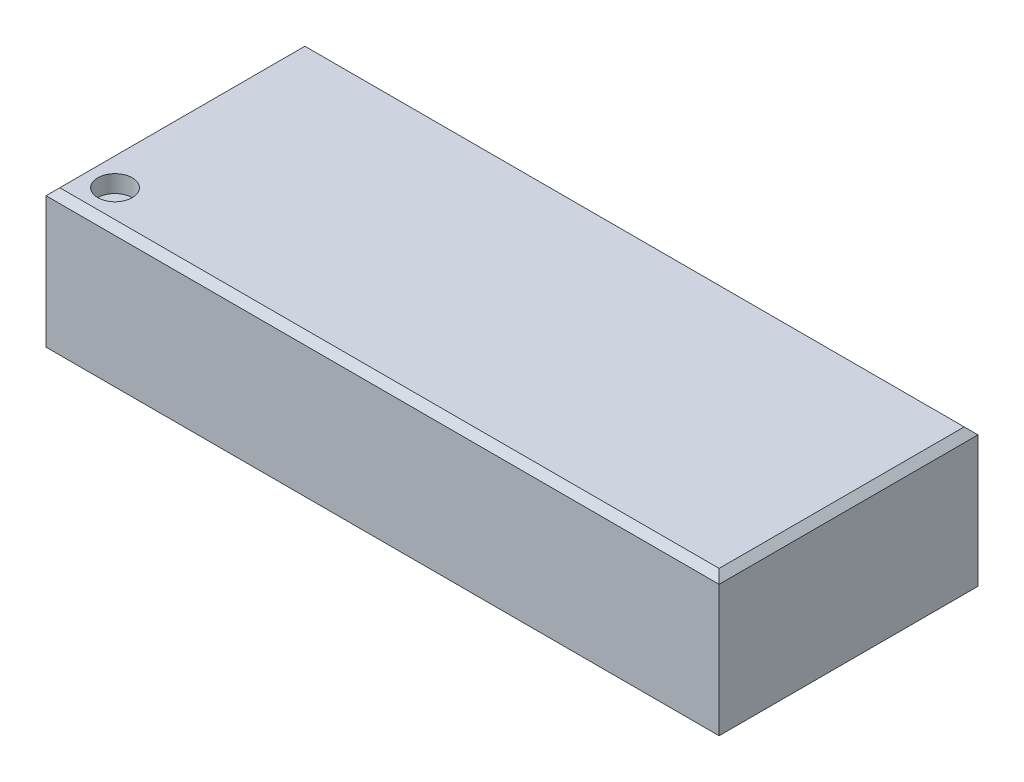
ISO-10303-21;
HEADER;
FILE_DESCRIPTION(('STEP AP214'),'2;1');
FILE_NAME('part.step','',(''),(''),'','','');
FILE_SCHEMA(('AUTOMOTIVE_DESIGN { 1 0 10303 214 1 1 1 1 }'));
ENDSEC;
DATA;
#1=APPLICATION_CONTEXT('core data for automotive mechanical design processes');
#2=APPLICATION_PROTOCOL_DEFINITION('international standard','automotive_design',2000,#1);
#3=PRODUCT_CONTEXT('',#1,'mechanical');
#4=PRODUCT('Part','Part','',(#3));
#5=PRODUCT_RELATED_PRODUCT_CATEGORY('part','',(#4));
#6=PRODUCT_DEFINITION_FORMATION('','',#4);
#7=PRODUCT_DEFINITION_CONTEXT('part definition',#1,'design');
#8=PRODUCT_DEFINITION('design','',#6,#7);
#9=PRODUCT_DEFINITION_SHAPE('','',#8);
#10=(LENGTH_UNIT() NAMED_UNIT(*) SI_UNIT(.MILLI.,.METRE.));
#11=(NAMED_UNIT(*) PLANE_ANGLE_UNIT() SI_UNIT($,.RADIAN.));
#12=(NAMED_UNIT(*) SI_UNIT($,.STERADIAN.) SOLID_ANGLE_UNIT());
#13=UNCERTAINTY_MEASURE_WITH_UNIT(LENGTH_MEASURE(1.E-05),#10,'distance_accuracy_value','');
#14=(GEOMETRIC_REPRESENTATION_CONTEXT(3) GLOBAL_UNCERTAINTY_ASSIGNED_CONTEXT((#13)) GLOBAL_UNIT_ASSIGNED_CONTEXT((#10,
#11,#12)) REPRESENTATION_CONTEXT('',''));
#15=CARTESIAN_POINT('',(0.,0.,0.));
#16=DIRECTION('',(0.,0.,1.));
#17=DIRECTION('',(1.,0.,0.));
#18=AXIS2_PLACEMENT_3D('',#15,#16,#17);
#19=CARTESIAN_POINT('',(-4.875,2.,-1.875));
#20=DIRECTION('',(1.,0.,0.));
#21=DIRECTION('',(0.,0.,-1.));
#22=AXIS2_PLACEMENT_3D('',#19,#20,#21);
#23=PLANE('',#22);
#24=DIRECTION('',(0.,-1.,0.));
#25=VECTOR('',#24,1.);
#26=CARTESIAN_POINT('',(-4.875,2.,1.875));
#27=LINE('',#26,#25);
#28=CARTESIAN_POINT('',(-4.875,1.9,1.875));
#29=VERTEX_POINT('',#28);
#30=CARTESIAN_POINT('',(-4.875,0.,1.875));
#31=VERTEX_POINT('',#30);
#32=EDGE_CURVE('E87',#29,#31,#27,.T.);
#33=ORIENTED_EDGE('',*,*,#32,.F.);
#34=DIRECTION('',(0.,0.,-1.));
#35=VECTOR('',#34,1.);
#36=CARTESIAN_POINT('',(-4.875,1.9,-1.875));
#37=LINE('',#36,#35);
#38=CARTESIAN_POINT('',(-4.875,1.9,-1.875));
#39=VERTEX_POINT('',#38);
#40=EDGE_CURVE('E11',#29,#39,#37,.T.);
#41=ORIENTED_EDGE('',*,*,#40,.T.);
#42=DIRECTION('',(0.,-1.,0.));
#43=VECTOR('',#42,1.);
#44=CARTESIAN_POINT('',(-4.875,2.,-1.875));
#45=LINE('',#44,#43);
#46=CARTESIAN_POINT('',(-4.875,0.,-1.875));
#47=VERTEX_POINT('',#46);
#48=EDGE_CURVE('E104',#39,#47,#45,.T.);
#49=ORIENTED_EDGE('',*,*,#48,.T.);
#50=DIRECTION('',(0.,0.,1.));
#51=VECTOR('',#50,1.);
#52=CARTESIAN_POINT('',(-4.875,0.,-1.875));
#53=LINE('',#52,#51);
#54=EDGE_CURVE('E100',#47,#31,#53,.T.);
#55=ORIENTED_EDGE('',*,*,#54,.T.);
#56=EDGE_LOOP('',(#33,#41,#49,#55));
#57=FACE_BOUND('',#56,.T.);
#58=ADVANCED_FACE('F35',(#57),#23,.F.);
#59=CARTESIAN_POINT('',(-4.875,2.,1.875));
#60=DIRECTION('',(0.,0.,-1.));
#61=DIRECTION('',(-1.,0.,0.));
#62=AXIS2_PLACEMENT_3D('',#59,#60,#61);
#63=PLANE('',#62);
#64=DIRECTION('',(0.,-1.,0.));
#65=VECTOR('',#64,1.);
#66=CARTESIAN_POINT('',(4.875,2.,1.875));
#67=LINE('',#66,#65);
#68=CARTESIAN_POINT('',(4.875,1.9,1.875));
#69=VERTEX_POINT('',#68);
#70=CARTESIAN_POINT('',(4.875,0.,1.875));
#71=VERTEX_POINT('',#70);
#72=EDGE_CURVE('E94',#69,#71,#67,.T.);
#73=ORIENTED_EDGE('',*,*,#72,.F.);
#74=DIRECTION('',(-1.,0.,0.));
#75=VECTOR('',#74,1.);
#76=CARTESIAN_POINT('',(-4.875,1.9,1.875));
#77=LINE('',#76,#75);
#78=EDGE_CURVE('E58',#69,#29,#77,.T.);
#79=ORIENTED_EDGE('',*,*,#78,.T.);
#80=ORIENTED_EDGE('',*,*,#32,.T.);
#81=DIRECTION('',(1.,0.,0.));
#82=VECTOR('',#81,1.);
#83=CARTESIAN_POINT('',(-4.875,0.,1.875));
#84=LINE('',#83,#82);
#85=EDGE_CURVE('E90',#31,#71,#84,.T.);
#86=ORIENTED_EDGE('',*,*,#85,.T.);
#87=EDGE_LOOP('',(#73,#79,#80,#86));
#88=FACE_BOUND('',#87,.T.);
#89=ADVANCED_FACE('F89',(#88),#63,.F.);
#90=CARTESIAN_POINT('',(4.875,2.,-1.875));
#91=DIRECTION('',(-1.,0.,0.));
#92=DIRECTION('',(0.,0.,1.));
#93=AXIS2_PLACEMENT_3D('',#90,#91,#92);
#94=PLANE('',#93);
#95=DIRECTION('',(0.,-1.,0.));
#96=VECTOR('',#95,1.);
#97=CARTESIAN_POINT('',(4.875,2.,-1.875));
#98=LINE('',#97,#96);
#99=CARTESIAN_POINT('',(4.875,1.9,-1.875));
#100=VERTEX_POINT('',#99);
#101=CARTESIAN_POINT('',(4.875,0.,-1.875));
#102=VERTEX_POINT('',#101);
#103=EDGE_CURVE('E117',#100,#102,#98,.T.);
#104=ORIENTED_EDGE('',*,*,#103,.F.);
#105=DIRECTION('',(0.,0.,1.));
#106=VECTOR('',#105,1.);
#107=CARTESIAN_POINT('',(4.875,1.9,1.875));
#108=LINE('',#107,#106);
#109=EDGE_CURVE('E128',#100,#69,#108,.T.);
#110=ORIENTED_EDGE('',*,*,#109,.T.);
#111=ORIENTED_EDGE('',*,*,#72,.T.);
#112=DIRECTION('',(0.,0.,-1.));
#113=VECTOR('',#112,1.);
#114=CARTESIAN_POINT('',(4.875,0.,-1.875));
#115=LINE('',#114,#113);
#116=EDGE_CURVE('E102',#71,#102,#115,.T.);
#117=ORIENTED_EDGE('',*,*,#116,.T.);
#118=EDGE_LOOP('',(#104,#110,#111,#117));
#119=FACE_BOUND('',#118,.T.);
#120=ADVANCED_FACE('F161',(#119),#94,.F.);
#121=CARTESIAN_POINT('',(-4.875,2.,-1.875));
#122=DIRECTION('',(0.,0.,1.));
#123=DIRECTION('',(1.,0.,0.));
#124=AXIS2_PLACEMENT_3D('',#121,#122,#123);
#125=PLANE('',#124);
#126=ORIENTED_EDGE('',*,*,#48,.F.);
#127=DIRECTION('',(1.,0.,0.));
#128=VECTOR('',#127,1.);
#129=CARTESIAN_POINT('',(4.875,1.9,-1.875));
#130=LINE('',#129,#128);
#131=EDGE_CURVE('E44',#39,#100,#130,.T.);
#132=ORIENTED_EDGE('',*,*,#131,.T.);
#133=ORIENTED_EDGE('',*,*,#103,.T.);
#134=DIRECTION('',(-1.,0.,0.));
#135=VECTOR('',#134,1.);
#136=CARTESIAN_POINT('',(-4.875,0.,-1.875));
#137=LINE('',#136,#135);
#138=EDGE_CURVE('E114',#102,#47,#137,.T.);
#139=ORIENTED_EDGE('',*,*,#138,.T.);
#140=EDGE_LOOP('',(#126,#132,#133,#139));
#141=FACE_BOUND('',#140,.T.);
#142=ADVANCED_FACE('F153',(#141),#125,.F.);
#143=CARTESIAN_POINT('',(0.,2.,0.));
#144=DIRECTION('',(0.,1.,0.));
#145=DIRECTION('',(0.,0.,1.));
#146=AXIS2_PLACEMENT_3D('',#143,#144,#145);
#147=PLANE('',#146);
#148=DIRECTION('',(1.,0.,0.));
#149=VECTOR('',#148,1.);
#150=CARTESIAN_POINT('',(4.875,2.,1.775));
#151=LINE('',#150,#149);
#152=CARTESIAN_POINT('',(-4.775,2.,1.775));
#153=VERTEX_POINT('',#152);
#154=CARTESIAN_POINT('',(4.775,2.,1.775));
#155=VERTEX_POINT('',#154);
#156=EDGE_CURVE('E123',#153,#155,#151,.T.);
#157=ORIENTED_EDGE('',*,*,#156,.T.);
#158=DIRECTION('',(0.,0.,-1.));
#159=VECTOR('',#158,1.);
#160=CARTESIAN_POINT('',(4.775,2.,-1.875));
#161=LINE('',#160,#159);
#162=CARTESIAN_POINT('',(4.775,2.,-1.775));
#163=VERTEX_POINT('',#162);
#164=EDGE_CURVE('E125',#155,#163,#161,.T.);
#165=ORIENTED_EDGE('',*,*,#164,.T.);
#166=DIRECTION('',(-1.,0.,0.));
#167=VECTOR('',#166,1.);
#168=CARTESIAN_POINT('',(-4.875,2.,-1.775));
#169=LINE('',#168,#167);
#170=CARTESIAN_POINT('',(-4.775,2.,-1.775));
#171=VERTEX_POINT('',#170);
#172=EDGE_CURVE('E121',#163,#171,#169,.T.);
#173=ORIENTED_EDGE('',*,*,#172,.T.);
#174=DIRECTION('',(0.,0.,1.));
#175=VECTOR('',#174,1.);
#176=CARTESIAN_POINT('',(-4.775,2.,1.875));
#177=LINE('',#176,#175);
#178=EDGE_CURVE('E93',#171,#153,#177,.T.);
#179=ORIENTED_EDGE('',*,*,#178,.T.);
#180=EDGE_LOOP('',(#157,#165,#173,#179));
#181=FACE_BOUND('',#180,.T.);
#182=CARTESIAN_POINT('',(-4.375,2.,1.375));
#183=DIRECTION('',(0.,1.,0.));
#184=DIRECTION('',(0.,0.,1.));
#185=AXIS2_PLACEMENT_3D('',#182,#183,#184);
#186=CIRCLE('',#185,0.25);
#187=CARTESIAN_POINT('',(-4.375,2.,1.625));
#188=VERTEX_POINT('',#187);
#189=EDGE_CURVE('E109',#188,#188,#186,.T.);
#190=ORIENTED_EDGE('',*,*,#189,.F.);
#191=EDGE_LOOP('',(#190));
#192=FACE_BOUND('',#191,.T.);
#193=ADVANCED_FACE('F151',(#181,#192),#147,.T.);
#194=CARTESIAN_POINT('',(0.,0.,0.));
#195=DIRECTION('',(0.,1.,0.));
#196=DIRECTION('',(0.,0.,1.));
#197=AXIS2_PLACEMENT_3D('',#194,#195,#196);
#198=PLANE('',#197);
#199=ORIENTED_EDGE('',*,*,#54,.F.);
#200=ORIENTED_EDGE('',*,*,#138,.F.);
#201=ORIENTED_EDGE('',*,*,#116,.F.);
#202=ORIENTED_EDGE('',*,*,#85,.F.);
#203=EDGE_LOOP('',(#199,#200,#201,#202));
#204=FACE_BOUND('',#203,.T.);
#205=ADVANCED_FACE('F98',(#204),#198,.F.);
#206=CARTESIAN_POINT('',(-4.375,1.75,1.375));
#207=DIRECTION('',(0.,1.,0.));
#208=DIRECTION('',(0.,0.,1.));
#209=AXIS2_PLACEMENT_3D('',#206,#207,#208);
#210=CYLINDRICAL_SURFACE('',#209,0.25);
#211=CARTESIAN_POINT('',(-4.375,1.75,1.375));
#212=DIRECTION('',(0.,1.,0.));
#213=DIRECTION('',(0.,0.,1.));
#214=AXIS2_PLACEMENT_3D('',#211,#212,#213);
#215=CIRCLE('',#214,0.25);
#216=CARTESIAN_POINT('',(-4.375,1.75,1.625));
#217=VERTEX_POINT('',#216);
#218=EDGE_CURVE('E106',#217,#217,#215,.T.);
#219=ORIENTED_EDGE('',*,*,#218,.F.);
#220=EDGE_LOOP('',(#219));
#221=FACE_BOUND('',#220,.T.);
#222=ORIENTED_EDGE('',*,*,#189,.T.);
#223=EDGE_LOOP('',(#222));
#224=FACE_BOUND('',#223,.T.);
#225=ADVANCED_FACE('F149',(#221,#224),#210,.F.);
#226=CARTESIAN_POINT('',(-4.375,1.75,1.375));
#227=DIRECTION('',(0.,1.,0.));
#228=DIRECTION('',(0.,0.,1.));
#229=AXIS2_PLACEMENT_3D('',#226,#227,#228);
#230=PLANE('',#229);
#231=ORIENTED_EDGE('',*,*,#218,.T.);
#232=EDGE_LOOP('',(#231));
#233=FACE_BOUND('',#232,.T.);
#234=ADVANCED_FACE('F184',(#233),#230,.T.);
#235=CARTESIAN_POINT('',(-4.775,2.,0.));
#236=DIRECTION('',(-0.707106781186547,0.707106781186547,0.));
#237=DIRECTION('',(0.,0.,-1.));
#238=AXIS2_PLACEMENT_3D('',#235,#236,#237);
#239=PLANE('',#238);
#240=DIRECTION('',(-0.577350269189626,-0.577350269189626,-0.577350269189626));
#241=VECTOR('',#240,1.);
#242=CARTESIAN_POINT('',(-4.18333333333333,2.59166666666667,-1.18333333333333));
#243=LINE('',#242,#241);
#244=EDGE_CURVE('E136',#39,#171,#243,.F.);
#245=ORIENTED_EDGE('',*,*,#244,.F.);
#246=ORIENTED_EDGE('',*,*,#40,.F.);
#247=DIRECTION('',(0.577350269189626,0.577350269189626,-0.577350269189626));
#248=VECTOR('',#247,1.);
#249=CARTESIAN_POINT('',(-4.18333333333333,2.59166666666667,1.18333333333333));
#250=LINE('',#249,#248);
#251=EDGE_CURVE('E39',#153,#29,#250,.F.);
#252=ORIENTED_EDGE('',*,*,#251,.F.);
#253=ORIENTED_EDGE('',*,*,#178,.F.);
#254=EDGE_LOOP('',(#245,#246,#252,#253));
#255=FACE_BOUND('',#254,.T.);
#256=ADVANCED_FACE('F37',(#255),#239,.T.);
#257=CARTESIAN_POINT('',(0.,2.,1.775));
#258=DIRECTION('',(0.,0.707106781186547,0.707106781186547));
#259=DIRECTION('',(-1.,0.,0.));
#260=AXIS2_PLACEMENT_3D('',#257,#258,#259);
#261=PLANE('',#260);
#262=ORIENTED_EDGE('',*,*,#251,.T.);
#263=ORIENTED_EDGE('',*,*,#78,.F.);
#264=DIRECTION('',(-0.577350269189626,0.577350269189626,-0.577350269189626));
#265=VECTOR('',#264,1.);
#266=CARTESIAN_POINT('',(3.18333333333333,3.59166666666667,0.183333333333332));
#267=LINE('',#266,#265);
#268=EDGE_CURVE('E135',#155,#69,#267,.F.);
#269=ORIENTED_EDGE('',*,*,#268,.F.);
#270=ORIENTED_EDGE('',*,*,#156,.F.);
#271=EDGE_LOOP('',(#262,#263,#269,#270));
#272=FACE_BOUND('',#271,.T.);
#273=ADVANCED_FACE('F179',(#272),#261,.T.);
#274=CARTESIAN_POINT('',(0.,2.,-1.775));
#275=DIRECTION('',(0.,0.707106781186547,-0.707106781186547));
#276=DIRECTION('',(1.,0.,0.));
#277=AXIS2_PLACEMENT_3D('',#274,#275,#276);
#278=PLANE('',#277);
#279=ORIENTED_EDGE('',*,*,#244,.T.);
#280=ORIENTED_EDGE('',*,*,#172,.F.);
#281=DIRECTION('',(0.577350269189626,-0.577350269189626,-0.577350269189626));
#282=VECTOR('',#281,1.);
#283=CARTESIAN_POINT('',(3.18333333333333,3.59166666666667,-0.183333333333335));
#284=LINE('',#283,#282);
#285=EDGE_CURVE('E133',#100,#163,#284,.F.);
#286=ORIENTED_EDGE('',*,*,#285,.F.);
#287=ORIENTED_EDGE('',*,*,#131,.F.);
#288=EDGE_LOOP('',(#279,#280,#286,#287));
#289=FACE_BOUND('',#288,.T.);
#290=ADVANCED_FACE('F176',(#289),#278,.T.);
#291=CARTESIAN_POINT('',(4.775,2.,0.));
#292=DIRECTION('',(0.707106781186547,0.707106781186547,0.));
#293=DIRECTION('',(0.,0.,1.));
#294=AXIS2_PLACEMENT_3D('',#291,#292,#293);
#295=PLANE('',#294);
#296=ORIENTED_EDGE('',*,*,#268,.T.);
#297=ORIENTED_EDGE('',*,*,#109,.F.);
#298=ORIENTED_EDGE('',*,*,#285,.T.);
#299=ORIENTED_EDGE('',*,*,#164,.F.);
#300=EDGE_LOOP('',(#296,#297,#298,#299));
#301=FACE_BOUND('',#300,.T.);
#302=ADVANCED_FACE('F173',(#301),#295,.T.);
#303=CLOSED_SHELL('',(#58,#89,#120,#142,#193,#205,#225,#234,#256,#273,#290,#302));
#304=MANIFOLD_SOLID_BREP('B2',#303);
#305=ADVANCED_BREP_SHAPE_REPRESENTATION('',(#18,#304),#14);
#306=SHAPE_DEFINITION_REPRESENTATION(#9,#305);
ENDSEC;
END-ISO-10303-21;
